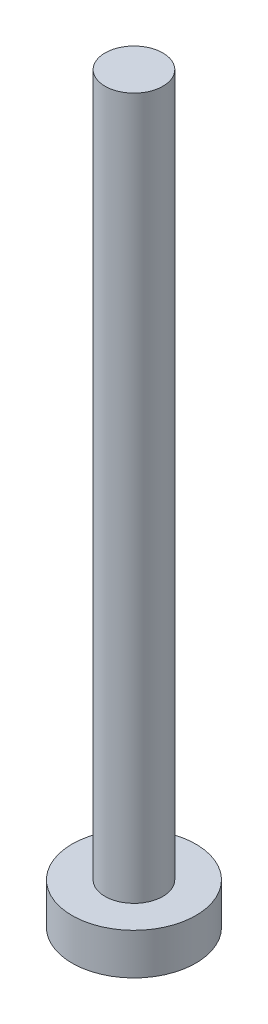
ISO-10303-21;
HEADER;
FILE_DESCRIPTION(('STEP AP214'),'2;1');
FILE_NAME('part.step','',(''),(''),'','','');
FILE_SCHEMA(('AUTOMOTIVE_DESIGN { 1 0 10303 214 1 1 1 1 }'));
ENDSEC;
DATA;
#1=APPLICATION_CONTEXT('core data for automotive mechanical design processes');
#2=APPLICATION_PROTOCOL_DEFINITION('international standard','automotive_design',2000,#1);
#3=PRODUCT_CONTEXT('',#1,'mechanical');
#4=PRODUCT('Part','Part','',(#3));
#5=PRODUCT_RELATED_PRODUCT_CATEGORY('part','',(#4));
#6=PRODUCT_DEFINITION_FORMATION('','',#4);
#7=PRODUCT_DEFINITION_CONTEXT('part definition',#1,'design');
#8=PRODUCT_DEFINITION('design','',#6,#7);
#9=PRODUCT_DEFINITION_SHAPE('','',#8);
#10=(LENGTH_UNIT() NAMED_UNIT(*) SI_UNIT(.MILLI.,.METRE.));
#11=(NAMED_UNIT(*) PLANE_ANGLE_UNIT() SI_UNIT($,.RADIAN.));
#12=(NAMED_UNIT(*) SI_UNIT($,.STERADIAN.) SOLID_ANGLE_UNIT());
#13=UNCERTAINTY_MEASURE_WITH_UNIT(LENGTH_MEASURE(1.E-05),#10,'distance_accuracy_value','');
#14=(GEOMETRIC_REPRESENTATION_CONTEXT(3) GLOBAL_UNCERTAINTY_ASSIGNED_CONTEXT((#13)) GLOBAL_UNIT_ASSIGNED_CONTEXT((#10,
#11,#12)) REPRESENTATION_CONTEXT('',''));
#15=CARTESIAN_POINT('',(0.,0.,0.));
#16=DIRECTION('',(0.,0.,1.));
#17=DIRECTION('',(1.,0.,0.));
#18=AXIS2_PLACEMENT_3D('',#15,#16,#17);
#19=CARTESIAN_POINT('',(-3.,0.,0.));
#20=DIRECTION('',(0.,-1.,0.));
#21=DIRECTION('',(1.,0.,0.));
#22=AXIS2_PLACEMENT_3D('',#19,#20,#21);
#23=PLANE('',#22);
#24=CARTESIAN_POINT('',(0.,0.,0.));
#25=DIRECTION('',(0.,1.,0.));
#26=DIRECTION('',(-1.,0.,0.));
#27=AXIS2_PLACEMENT_3D('',#24,#25,#26);
#28=CIRCLE('',#27,3.);
#29=CARTESIAN_POINT('',(-3.,0.,0.));
#30=VERTEX_POINT('',#29);
#31=EDGE_CURVE('E10',#30,#30,#28,.T.);
#32=ORIENTED_EDGE('',*,*,#31,.F.);
#33=EDGE_LOOP('',(#32));
#34=FACE_BOUND('',#33,.T.);
#35=ADVANCED_FACE('F32',(#34),#23,.T.);
#36=CARTESIAN_POINT('',(0.,36.,0.));
#37=DIRECTION('',(0.,1.,0.));
#38=DIRECTION('',(-1.,0.,0.));
#39=AXIS2_PLACEMENT_3D('',#36,#37,#38);
#40=CYLINDRICAL_SURFACE('',#39,3.);
#41=ORIENTED_EDGE('',*,*,#31,.T.);
#42=EDGE_LOOP('',(#41));
#43=FACE_BOUND('',#42,.T.);
#44=CARTESIAN_POINT('',(0.,2.,0.));
#45=DIRECTION('',(0.,1.,0.));
#46=DIRECTION('',(-1.,0.,0.));
#47=AXIS2_PLACEMENT_3D('',#44,#45,#46);
#48=CIRCLE('',#47,3.);
#49=CARTESIAN_POINT('',(-3.,2.,0.));
#50=VERTEX_POINT('',#49);
#51=EDGE_CURVE('E38',#50,#50,#48,.T.);
#52=ORIENTED_EDGE('',*,*,#51,.F.);
#53=EDGE_LOOP('',(#52));
#54=FACE_BOUND('',#53,.T.);
#55=ADVANCED_FACE('F64',(#43,#54),#40,.T.);
#56=CARTESIAN_POINT('',(-1.4,2.,0.));
#57=DIRECTION('',(0.,1.,0.));
#58=DIRECTION('',(-1.,0.,0.));
#59=AXIS2_PLACEMENT_3D('',#56,#57,#58);
#60=PLANE('',#59);
#61=ORIENTED_EDGE('',*,*,#51,.T.);
#62=EDGE_LOOP('',(#61));
#63=FACE_BOUND('',#62,.T.);
#64=CARTESIAN_POINT('',(0.,2.,0.));
#65=DIRECTION('',(0.,1.,0.));
#66=DIRECTION('',(-1.,0.,0.));
#67=AXIS2_PLACEMENT_3D('',#64,#65,#66);
#68=CIRCLE('',#67,1.4);
#69=CARTESIAN_POINT('',(-1.4,2.,0.));
#70=VERTEX_POINT('',#69);
#71=EDGE_CURVE('E42',#70,#70,#68,.T.);
#72=ORIENTED_EDGE('',*,*,#71,.F.);
#73=EDGE_LOOP('',(#72));
#74=FACE_BOUND('',#73,.T.);
#75=ADVANCED_FACE('F56',(#63,#74),#60,.T.);
#76=CARTESIAN_POINT('',(0.,36.,0.));
#77=DIRECTION('',(0.,1.,0.));
#78=DIRECTION('',(-1.,0.,0.));
#79=AXIS2_PLACEMENT_3D('',#76,#77,#78);
#80=CYLINDRICAL_SURFACE('',#79,1.4);
#81=ORIENTED_EDGE('',*,*,#71,.T.);
#82=EDGE_LOOP('',(#81));
#83=FACE_BOUND('',#82,.T.);
#84=CARTESIAN_POINT('',(0.,36.,0.));
#85=DIRECTION('',(0.,1.,0.));
#86=DIRECTION('',(-1.,0.,0.));
#87=AXIS2_PLACEMENT_3D('',#84,#85,#86);
#88=CIRCLE('',#87,1.4);
#89=CARTESIAN_POINT('',(-1.4,36.,0.));
#90=VERTEX_POINT('',#89);
#91=EDGE_CURVE('E46',#90,#90,#88,.T.);
#92=ORIENTED_EDGE('',*,*,#91,.F.);
#93=EDGE_LOOP('',(#92));
#94=FACE_BOUND('',#93,.T.);
#95=ADVANCED_FACE('F54',(#83,#94),#80,.T.);
#96=CARTESIAN_POINT('',(-1.4,36.,0.));
#97=DIRECTION('',(0.,1.,0.));
#98=DIRECTION('',(-1.,0.,0.));
#99=AXIS2_PLACEMENT_3D('',#96,#97,#98);
#100=PLANE('',#99);
#101=ORIENTED_EDGE('',*,*,#91,.T.);
#102=EDGE_LOOP('',(#101));
#103=FACE_BOUND('',#102,.T.);
#104=ADVANCED_FACE('F52',(#103),#100,.T.);
#105=CLOSED_SHELL('',(#35,#55,#75,#95,#104));
#106=MANIFOLD_SOLID_BREP('B2',#105);
#107=ADVANCED_BREP_SHAPE_REPRESENTATION('',(#18,#106),#14);
#108=SHAPE_DEFINITION_REPRESENTATION(#9,#107);
ENDSEC;
END-ISO-10303-21;
